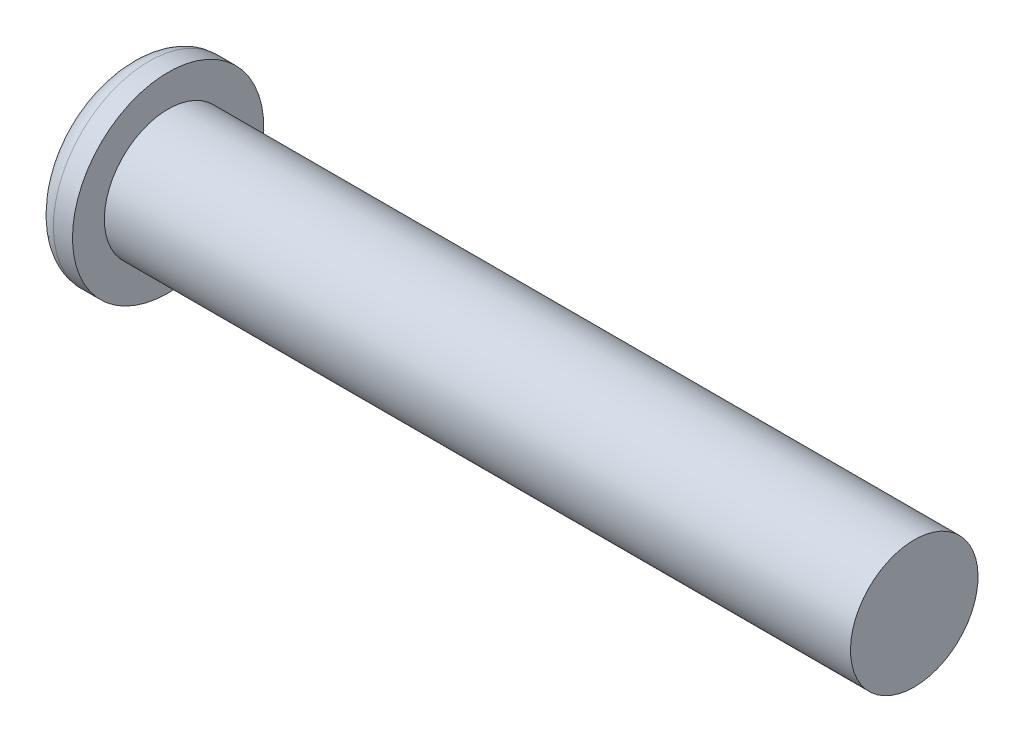
ISO-10303-21;
HEADER;
FILE_DESCRIPTION(('STEP AP214'),'2;1');
FILE_NAME('part.step','',(''),(''),'','','');
FILE_SCHEMA(('AUTOMOTIVE_DESIGN { 1 0 10303 214 1 1 1 1 }'));
ENDSEC;
DATA;
#1=APPLICATION_CONTEXT('core data for automotive mechanical design processes');
#2=APPLICATION_PROTOCOL_DEFINITION('international standard','automotive_design',2000,#1);
#3=PRODUCT_CONTEXT('',#1,'mechanical');
#4=PRODUCT('Part','Part','',(#3));
#5=PRODUCT_RELATED_PRODUCT_CATEGORY('part','',(#4));
#6=PRODUCT_DEFINITION_FORMATION('','',#4);
#7=PRODUCT_DEFINITION_CONTEXT('part definition',#1,'design');
#8=PRODUCT_DEFINITION('design','',#6,#7);
#9=PRODUCT_DEFINITION_SHAPE('','',#8);
#10=(LENGTH_UNIT() NAMED_UNIT(*) SI_UNIT(.MILLI.,.METRE.));
#11=(NAMED_UNIT(*) PLANE_ANGLE_UNIT() SI_UNIT($,.RADIAN.));
#12=(NAMED_UNIT(*) SI_UNIT($,.STERADIAN.) SOLID_ANGLE_UNIT());
#13=UNCERTAINTY_MEASURE_WITH_UNIT(LENGTH_MEASURE(1.E-05),#10,'distance_accuracy_value','');
#14=(GEOMETRIC_REPRESENTATION_CONTEXT(3) GLOBAL_UNCERTAINTY_ASSIGNED_CONTEXT((#13)) GLOBAL_UNIT_ASSIGNED_CONTEXT((#10,
#11,#12)) REPRESENTATION_CONTEXT('',''));
#15=CARTESIAN_POINT('',(0.,0.,0.));
#16=DIRECTION('',(0.,0.,1.));
#17=DIRECTION('',(1.,0.,0.));
#18=AXIS2_PLACEMENT_3D('',#15,#16,#17);
#19=CARTESIAN_POINT('',(58.5,0.,0.));
#20=DIRECTION('',(-1.,0.,0.));
#21=DIRECTION('',(0.,-1.,0.));
#22=AXIS2_PLACEMENT_3D('',#19,#20,#21);
#23=PLANE('',#22);
#24=CARTESIAN_POINT('',(58.5,0.,0.));
#25=DIRECTION('',(-1.,0.,0.));
#26=DIRECTION('',(0.,-1.,0.));
#27=AXIS2_PLACEMENT_3D('',#24,#25,#26);
#28=CIRCLE('',#27,5.);
#29=CARTESIAN_POINT('',(58.5,-4.99999999999999,0.));
#30=VERTEX_POINT('',#29);
#31=EDGE_CURVE('E11',#30,#30,#28,.T.);
#32=ORIENTED_EDGE('',*,*,#31,.F.);
#33=EDGE_LOOP('',(#32));
#34=FACE_BOUND('',#33,.T.);
#35=ADVANCED_FACE('F37',(#34),#23,.F.);
#36=CARTESIAN_POINT('',(0.,0.,0.));
#37=DIRECTION('',(-1.,0.,0.));
#38=DIRECTION('',(0.,-1.,0.));
#39=AXIS2_PLACEMENT_3D('',#36,#37,#38);
#40=CYLINDRICAL_SURFACE('',#39,5.);
#41=CARTESIAN_POINT('',(0.,0.,0.));
#42=DIRECTION('',(-1.,0.,0.));
#43=DIRECTION('',(0.,-1.,0.));
#44=AXIS2_PLACEMENT_3D('',#41,#42,#43);
#45=CIRCLE('',#44,5.);
#46=CARTESIAN_POINT('',(0.,-5.,0.));
#47=VERTEX_POINT('',#46);
#48=EDGE_CURVE('E45',#47,#47,#45,.T.);
#49=ORIENTED_EDGE('',*,*,#48,.F.);
#50=EDGE_LOOP('',(#49));
#51=FACE_BOUND('',#50,.T.);
#52=ORIENTED_EDGE('',*,*,#31,.T.);
#53=EDGE_LOOP('',(#52));
#54=FACE_BOUND('',#53,.T.);
#55=ADVANCED_FACE('F65',(#51,#54),#40,.T.);
#56=CARTESIAN_POINT('',(0.,5.,0.));
#57=DIRECTION('',(-1.,0.,0.));
#58=DIRECTION('',(0.,-1.,0.));
#59=AXIS2_PLACEMENT_3D('',#56,#57,#58);
#60=PLANE('',#59);
#61=CARTESIAN_POINT('',(0.,0.,0.));
#62=DIRECTION('',(-1.,0.,0.));
#63=DIRECTION('',(0.,-1.,0.));
#64=AXIS2_PLACEMENT_3D('',#61,#62,#63);
#65=CIRCLE('',#64,7.5);
#66=CARTESIAN_POINT('',(0.,-7.5,0.));
#67=VERTEX_POINT('',#66);
#68=EDGE_CURVE('E56',#67,#67,#65,.T.);
#69=ORIENTED_EDGE('',*,*,#68,.F.);
#70=EDGE_LOOP('',(#69));
#71=FACE_BOUND('',#70,.T.);
#72=ORIENTED_EDGE('',*,*,#48,.T.);
#73=EDGE_LOOP('',(#72));
#74=FACE_BOUND('',#73,.T.);
#75=ADVANCED_FACE('F63',(#71,#74),#60,.F.);
#76=CARTESIAN_POINT('',(0.,0.,0.));
#77=DIRECTION('',(-1.,0.,0.));
#78=DIRECTION('',(0.,-1.,0.));
#79=AXIS2_PLACEMENT_3D('',#76,#77,#78);
#80=CYLINDRICAL_SURFACE('',#79,7.5);
#81=CARTESIAN_POINT('',(-1.5,0.,0.));
#82=DIRECTION('',(-1.,0.,0.));
#83=DIRECTION('',(0.,-1.,0.));
#84=AXIS2_PLACEMENT_3D('',#81,#82,#83);
#85=CIRCLE('',#84,7.5);
#86=CARTESIAN_POINT('',(-1.5,-7.5,0.));
#87=VERTEX_POINT('',#86);
#88=EDGE_CURVE('E54',#87,#87,#85,.T.);
#89=ORIENTED_EDGE('',*,*,#88,.F.);
#90=EDGE_LOOP('',(#89));
#91=FACE_BOUND('',#90,.T.);
#92=ORIENTED_EDGE('',*,*,#68,.T.);
#93=EDGE_LOOP('',(#92));
#94=FACE_BOUND('',#93,.T.);
#95=ADVANCED_FACE('F51',(#91,#94),#80,.T.);
#96=CARTESIAN_POINT('',(-1.5,0.,0.));
#97=DIRECTION('',(0.,0.,1.));
#98=DIRECTION('',(0.,-1.,0.));
#99=AXIS2_PLACEMENT_3D('',#96,#97,#98);
#100=ELLIPSE('',#99,7.5,3.);
#101=TRIMMED_CURVE('',#100,(PARAMETER_VALUE(4.71238898038469)),
(PARAMETER_VALUE(7.85398163397448)),.T.,.PARAMETER.);
#102=CARTESIAN_POINT('',(1.5,0.,0.));
#103=DIRECTION('',(-1.,0.,0.));
#104=AXIS1_PLACEMENT('',#102,#103);
#105=SURFACE_OF_REVOLUTION('',#101,#104);
#106=CARTESIAN_POINT('',(-4.5,0.,0.));
#107=VERTEX_POINT('',#106);
#108=VERTEX_LOOP('',#107);
#109=FACE_BOUND('',#108,.T.);
#110=ORIENTED_EDGE('',*,*,#88,.T.);
#111=EDGE_LOOP('',(#110));
#112=FACE_BOUND('',#111,.T.);
#113=ADVANCED_FACE('F39',(#109,#112),#105,.F.);
#114=CLOSED_SHELL('',(#35,#55,#75,#95,#113));
#115=MANIFOLD_SOLID_BREP('B2',#114);
#116=ADVANCED_BREP_SHAPE_REPRESENTATION('',(#18,#115),#14);
#117=SHAPE_DEFINITION_REPRESENTATION(#9,#116);
ENDSEC;
END-ISO-10303-21;
